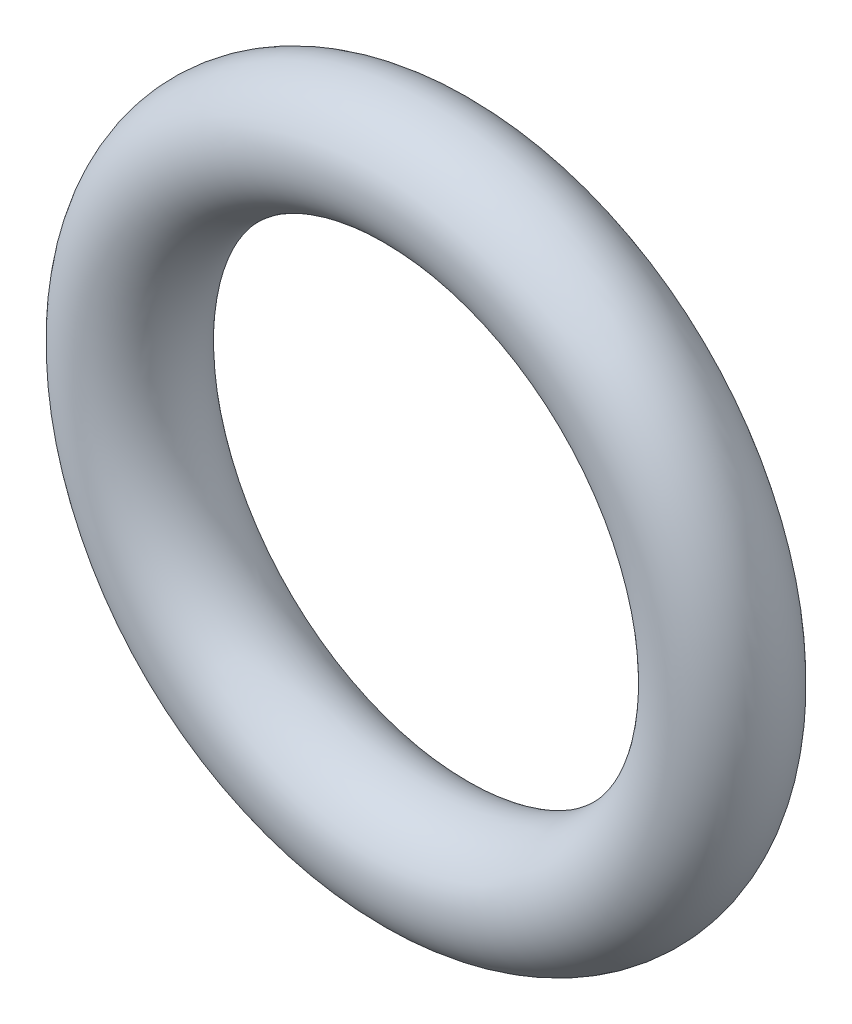
ISO-10303-21;
HEADER;
FILE_DESCRIPTION(('STEP AP214'),'2;1');
FILE_NAME('part.step','',(''),(''),'','','');
FILE_SCHEMA(('AUTOMOTIVE_DESIGN { 1 0 10303 214 1 1 1 1 }'));
ENDSEC;
DATA;
#1=APPLICATION_CONTEXT('core data for automotive mechanical design processes');
#2=APPLICATION_PROTOCOL_DEFINITION('international standard','automotive_design',2000,#1);
#3=PRODUCT_CONTEXT('',#1,'mechanical');
#4=PRODUCT('Part','Part','',(#3));
#5=PRODUCT_RELATED_PRODUCT_CATEGORY('part','',(#4));
#6=PRODUCT_DEFINITION_FORMATION('','',#4);
#7=PRODUCT_DEFINITION_CONTEXT('part definition',#1,'design');
#8=PRODUCT_DEFINITION('design','',#6,#7);
#9=PRODUCT_DEFINITION_SHAPE('','',#8);
#10=(LENGTH_UNIT() NAMED_UNIT(*) SI_UNIT(.MILLI.,.METRE.));
#11=(NAMED_UNIT(*) PLANE_ANGLE_UNIT() SI_UNIT($,.RADIAN.));
#12=(NAMED_UNIT(*) SI_UNIT($,.STERADIAN.) SOLID_ANGLE_UNIT());
#13=UNCERTAINTY_MEASURE_WITH_UNIT(LENGTH_MEASURE(1.E-05),#10,'distance_accuracy_value','');
#14=(GEOMETRIC_REPRESENTATION_CONTEXT(3) GLOBAL_UNCERTAINTY_ASSIGNED_CONTEXT((#13)) GLOBAL_UNIT_ASSIGNED_CONTEXT((#10,
#11,#12)) REPRESENTATION_CONTEXT('',''));
#15=CARTESIAN_POINT('',(0.,0.,0.));
#16=DIRECTION('',(0.,0.,1.));
#17=DIRECTION('',(1.,0.,0.));
#18=AXIS2_PLACEMENT_3D('',#15,#16,#17);
#19=CARTESIAN_POINT('',(0.,-8.43359375,0.));
#20=DIRECTION('',(0.,0.,1.));
#21=DIRECTION('',(1.,0.,0.));
#22=AXIS2_PLACEMENT_3D('',#19,#20,#21);
#23=TOROIDAL_SURFACE('',#22,8.43359375,1.68671875);
#24=CARTESIAN_POINT('',(0.,0.,0.));
#25=DIRECTION('',(1.,0.,0.));
#26=DIRECTION('',(0.,0.,-1.));
#27=AXIS2_PLACEMENT_3D('',#24,#25,#26);
#28=CIRCLE('',#27,1.68671875);
#29=CARTESIAN_POINT('',(0.,1.68671875,0.));
#30=VERTEX_POINT('',#29);
#31=EDGE_CURVE('E10',#30,#30,#28,.T.);
#32=CARTESIAN_POINT('',(0.,-8.43359375,0.));
#33=DIRECTION('',(0.,0.,1.));
#34=DIRECTION('',(1.,0.,0.));
#35=AXIS2_PLACEMENT_3D('',#32,#33,#34);
#36=CIRCLE('',#35,10.1203125);
#37=EDGE_CURVE('',#30,#30,#36,.T.);
#38=ORIENTED_EDGE('',*,*,#31,.F.);
#39=ORIENTED_EDGE('',*,*,#31,.T.);
#40=ORIENTED_EDGE('',*,*,#37,.T.);
#41=ORIENTED_EDGE('',*,*,#37,.F.);
#42=EDGE_LOOP('',(#38,#40,#39,#41));
#43=FACE_BOUND('',#42,.T.);
#44=ADVANCED_FACE('F28',(#43),#23,.T.);
#45=CLOSED_SHELL('',(#44));
#46=MANIFOLD_SOLID_BREP('B2',#45);
#47=ADVANCED_BREP_SHAPE_REPRESENTATION('',(#18,#46),#14);
#48=SHAPE_DEFINITION_REPRESENTATION(#9,#47);
ENDSEC;
END-ISO-10303-21;
